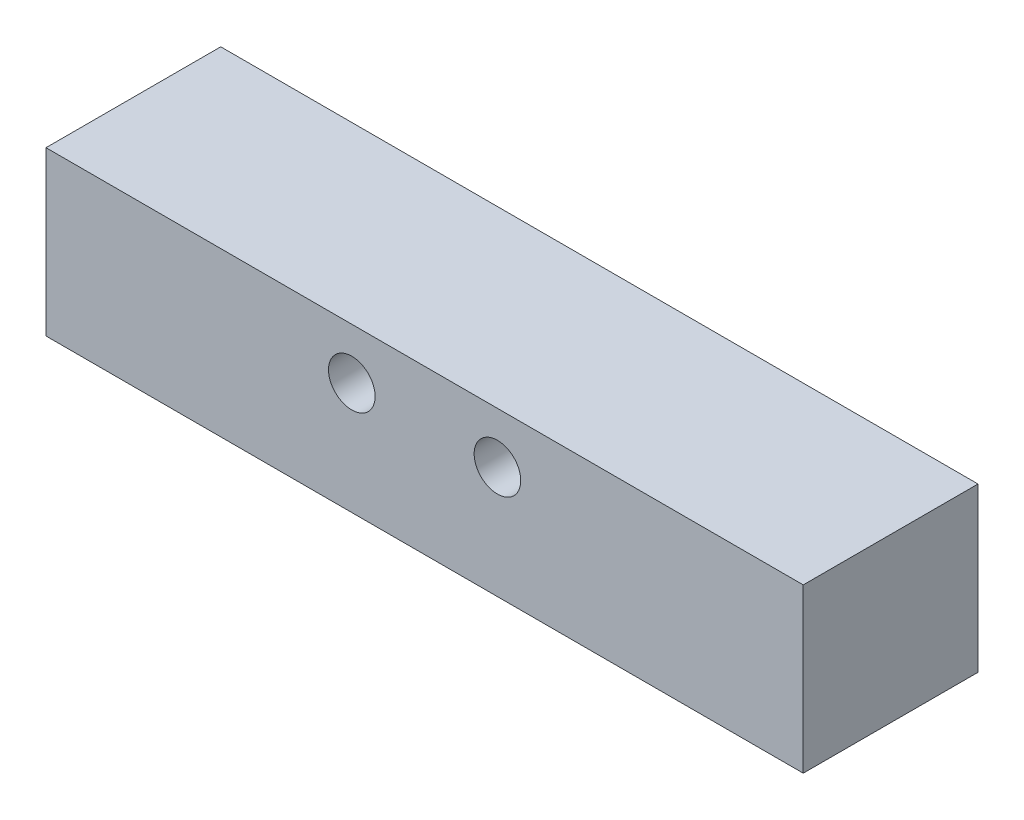
ISO-10303-21;
HEADER;
FILE_DESCRIPTION(('STEP AP214'),'2;1');
FILE_NAME('part.step','',(''),(''),'','','');
FILE_SCHEMA(('AUTOMOTIVE_DESIGN { 1 0 10303 214 1 1 1 1 }'));
ENDSEC;
DATA;
#1=APPLICATION_CONTEXT('core data for automotive mechanical design processes');
#2=APPLICATION_PROTOCOL_DEFINITION('international standard','automotive_design',2000,#1);
#3=PRODUCT_CONTEXT('',#1,'mechanical');
#4=PRODUCT('Part','Part','',(#3));
#5=PRODUCT_RELATED_PRODUCT_CATEGORY('part','',(#4));
#6=PRODUCT_DEFINITION_FORMATION('','',#4);
#7=PRODUCT_DEFINITION_CONTEXT('part definition',#1,'design');
#8=PRODUCT_DEFINITION('design','',#6,#7);
#9=PRODUCT_DEFINITION_SHAPE('','',#8);
#10=(LENGTH_UNIT() NAMED_UNIT(*) SI_UNIT(.MILLI.,.METRE.));
#11=(NAMED_UNIT(*) PLANE_ANGLE_UNIT() SI_UNIT($,.RADIAN.));
#12=(NAMED_UNIT(*) SI_UNIT($,.STERADIAN.) SOLID_ANGLE_UNIT());
#13=UNCERTAINTY_MEASURE_WITH_UNIT(LENGTH_MEASURE(1.E-05),#10,'distance_accuracy_value','');
#14=(GEOMETRIC_REPRESENTATION_CONTEXT(3) GLOBAL_UNCERTAINTY_ASSIGNED_CONTEXT((#13)) GLOBAL_UNIT_ASSIGNED_CONTEXT((#10,
#11,#12)) REPRESENTATION_CONTEXT('',''));
#15=CARTESIAN_POINT('',(0.,0.,0.));
#16=DIRECTION('',(0.,0.,1.));
#17=DIRECTION('',(1.,0.,0.));
#18=AXIS2_PLACEMENT_3D('',#15,#16,#17);
#19=CARTESIAN_POINT('',(-26.,-11.2,5.99999999999989));
#20=DIRECTION('',(0.,1.,0.));
#21=DIRECTION('',(0.,0.,-1.));
#22=AXIS2_PLACEMENT_3D('',#19,#20,#21);
#23=PLANE('',#22);
#24=CARTESIAN_POINT('',(-13.5,-11.2,0.));
#25=DIRECTION('',(0.,1.,0.));
#26=DIRECTION('',(0.,0.,-1.));
#27=AXIS2_PLACEMENT_3D('',#24,#25,#26);
#28=CIRCLE('',#27,4.5);
#29=CARTESIAN_POINT('',(-13.5,-11.2,-4.50000000000007));
#30=VERTEX_POINT('',#29);
#31=EDGE_CURVE('E101',#30,#30,#28,.F.);
#32=ORIENTED_EDGE('',*,*,#31,.F.);
#33=EDGE_LOOP('',(#32));
#34=FACE_BOUND('',#33,.T.);
#35=DIRECTION('',(0.,0.,1.));
#36=VECTOR('',#35,1.);
#37=CARTESIAN_POINT('',(26.,-11.2,6.00000000000007));
#38=LINE('',#37,#36);
#39=CARTESIAN_POINT('',(26.,-11.2,-5.99999999999993));
#40=VERTEX_POINT('',#39);
#41=CARTESIAN_POINT('',(26.,-11.2,6.00000000000007));
#42=VERTEX_POINT('',#41);
#43=EDGE_CURVE('E63',#40,#42,#38,.T.);
#44=ORIENTED_EDGE('',*,*,#43,.T.);
#45=DIRECTION('',(1.,0.,0.));
#46=VECTOR('',#45,1.);
#47=CARTESIAN_POINT('',(-26.,-11.2,5.99999999999989));
#48=LINE('',#47,#46);
#49=CARTESIAN_POINT('',(-26.,-11.2,5.99999999999989));
#50=VERTEX_POINT('',#49);
#51=EDGE_CURVE('E95',#50,#42,#48,.T.);
#52=ORIENTED_EDGE('',*,*,#51,.F.);
#53=DIRECTION('',(0.,0.,1.));
#54=VECTOR('',#53,1.);
#55=CARTESIAN_POINT('',(-26.,-11.2,5.99999999999989));
#56=LINE('',#55,#54);
#57=CARTESIAN_POINT('',(-26.,-11.2,-6.00000000000011));
#58=VERTEX_POINT('',#57);
#59=EDGE_CURVE('E36',#58,#50,#56,.T.);
#60=ORIENTED_EDGE('',*,*,#59,.F.);
#61=DIRECTION('',(1.,0.,0.));
#62=VECTOR('',#61,1.);
#63=CARTESIAN_POINT('',(-26.,-11.2,-6.00000000000011));
#64=LINE('',#63,#62);
#65=EDGE_CURVE('E75',#58,#40,#64,.T.);
#66=ORIENTED_EDGE('',*,*,#65,.T.);
#67=EDGE_LOOP('',(#44,#52,#60,#66));
#68=FACE_BOUND('',#67,.T.);
#69=CARTESIAN_POINT('',(0.,-11.2,0.));
#70=DIRECTION('',(0.,1.,0.));
#71=DIRECTION('',(0.,0.,-1.));
#72=AXIS2_PLACEMENT_3D('',#69,#70,#71);
#73=CIRCLE('',#72,4.5);
#74=CARTESIAN_POINT('',(0.,-11.2,-4.50000000000002));
#75=VERTEX_POINT('',#74);
#76=EDGE_CURVE('E74',#75,#75,#73,.F.);
#77=ORIENTED_EDGE('',*,*,#76,.F.);
#78=EDGE_LOOP('',(#77));
#79=FACE_BOUND('',#78,.T.);
#80=CARTESIAN_POINT('',(13.5,-11.2,0.));
#81=DIRECTION('',(0.,1.,0.));
#82=DIRECTION('',(0.,0.,-1.));
#83=AXIS2_PLACEMENT_3D('',#80,#81,#82);
#84=CIRCLE('',#83,4.5);
#85=CARTESIAN_POINT('',(13.5,-11.2,-4.49999999999998));
#86=VERTEX_POINT('',#85);
#87=EDGE_CURVE('E104',#86,#86,#84,.F.);
#88=ORIENTED_EDGE('',*,*,#87,.F.);
#89=EDGE_LOOP('',(#88));
#90=FACE_BOUND('',#89,.T.);
#91=ADVANCED_FACE('F16',(#34,#68,#79,#90),#23,.F.);
#92=CARTESIAN_POINT('',(-26.,0.,5.99999999999993));
#93=DIRECTION('',(0.,-1.,0.));
#94=DIRECTION('',(0.,0.,1.));
#95=AXIS2_PLACEMENT_3D('',#92,#93,#94);
#96=PLANE('',#95);
#97=DIRECTION('',(0.,0.,-1.));
#98=VECTOR('',#97,1.);
#99=CARTESIAN_POINT('',(26.,0.,6.00000000000011));
#100=LINE('',#99,#98);
#101=CARTESIAN_POINT('',(26.,0.,6.00000000000011));
#102=VERTEX_POINT('',#101);
#103=CARTESIAN_POINT('',(26.,0.,-5.99999999999989));
#104=VERTEX_POINT('',#103);
#105=EDGE_CURVE('E62',#102,#104,#100,.T.);
#106=ORIENTED_EDGE('',*,*,#105,.T.);
#107=DIRECTION('',(1.,0.,0.));
#108=VECTOR('',#107,1.);
#109=CARTESIAN_POINT('',(-26.,0.,-6.00000000000007));
#110=LINE('',#109,#108);
#111=CARTESIAN_POINT('',(-26.,0.,-6.00000000000007));
#112=VERTEX_POINT('',#111);
#113=EDGE_CURVE('E69',#112,#104,#110,.T.);
#114=ORIENTED_EDGE('',*,*,#113,.F.);
#115=DIRECTION('',(0.,0.,-1.));
#116=VECTOR('',#115,1.);
#117=CARTESIAN_POINT('',(-26.,0.,5.99999999999993));
#118=LINE('',#117,#116);
#119=CARTESIAN_POINT('',(-26.,0.,5.99999999999993));
#120=VERTEX_POINT('',#119);
#121=EDGE_CURVE('E89',#120,#112,#118,.T.);
#122=ORIENTED_EDGE('',*,*,#121,.F.);
#123=DIRECTION('',(1.,0.,0.));
#124=VECTOR('',#123,1.);
#125=CARTESIAN_POINT('',(-26.,0.,5.99999999999993));
#126=LINE('',#125,#124);
#127=EDGE_CURVE('E78',#120,#102,#126,.T.);
#128=ORIENTED_EDGE('',*,*,#127,.T.);
#129=EDGE_LOOP('',(#106,#114,#122,#128));
#130=FACE_BOUND('',#129,.T.);
#131=ADVANCED_FACE('F18',(#130),#96,.F.);
#132=CARTESIAN_POINT('',(-26.,0.,-6.00000000000007));
#133=DIRECTION('',(0.,0.,1.));
#134=DIRECTION('',(0.,1.,0.));
#135=AXIS2_PLACEMENT_3D('',#132,#133,#134);
#136=PLANE('',#135);
#137=CARTESIAN_POINT('',(-4.99999999999996,-3.49999999999996,-6.00000000000001));
#138=DIRECTION('',(0.,0.,1.));
#139=DIRECTION('',(-1.,0.,0.));
#140=AXIS2_PLACEMENT_3D('',#137,#138,#139);
#141=CIRCLE('',#140,1.6);
#142=CARTESIAN_POINT('',(-6.59999999999996,-3.49999999999996,-6.00000000000002));
#143=VERTEX_POINT('',#142);
#144=EDGE_CURVE('E152',#143,#143,#141,.T.);
#145=ORIENTED_EDGE('',*,*,#144,.T.);
#146=EDGE_LOOP('',(#145));
#147=FACE_BOUND('',#146,.T.);
#148=CARTESIAN_POINT('',(5.00000000000004,-3.49999999999996,-5.99999999999998));
#149=DIRECTION('',(0.,0.,1.));
#150=DIRECTION('',(-1.,0.,0.));
#151=AXIS2_PLACEMENT_3D('',#148,#149,#150);
#152=CIRCLE('',#151,1.6);
#153=CARTESIAN_POINT('',(3.40000000000004,-3.49999999999996,-5.99999999999998));
#154=VERTEX_POINT('',#153);
#155=EDGE_CURVE('E155',#154,#154,#152,.T.);
#156=ORIENTED_EDGE('',*,*,#155,.T.);
#157=EDGE_LOOP('',(#156));
#158=FACE_BOUND('',#157,.T.);
#159=DIRECTION('',(0.,-1.,0.));
#160=VECTOR('',#159,1.);
#161=CARTESIAN_POINT('',(26.,0.,-5.99999999999989));
#162=LINE('',#161,#160);
#163=EDGE_CURVE('E57',#104,#40,#162,.T.);
#164=ORIENTED_EDGE('',*,*,#163,.T.);
#165=ORIENTED_EDGE('',*,*,#65,.F.);
#166=DIRECTION('',(0.,-1.,0.));
#167=VECTOR('',#166,1.);
#168=CARTESIAN_POINT('',(-26.,0.,-6.00000000000007));
#169=LINE('',#168,#167);
#170=EDGE_CURVE('E71',#112,#58,#169,.T.);
#171=ORIENTED_EDGE('',*,*,#170,.F.);
#172=ORIENTED_EDGE('',*,*,#113,.T.);
#173=EDGE_LOOP('',(#164,#165,#171,#172));
#174=FACE_BOUND('',#173,.T.);
#175=ADVANCED_FACE('F70',(#147,#158,#174),#136,.F.);
#176=CARTESIAN_POINT('',(-26.,0.,5.99999999999993));
#177=DIRECTION('',(0.,0.,-1.));
#178=DIRECTION('',(0.,-1.,0.));
#179=AXIS2_PLACEMENT_3D('',#176,#177,#178);
#180=PLANE('',#179);
#181=CARTESIAN_POINT('',(-5.,-3.5,5.99999999999999));
#182=DIRECTION('',(0.,0.,1.));
#183=DIRECTION('',(-1.,0.,0.));
#184=AXIS2_PLACEMENT_3D('',#181,#182,#183);
#185=CIRCLE('',#184,1.6);
#186=CARTESIAN_POINT('',(-6.6,-3.5,5.99999999999998));
#187=VERTEX_POINT('',#186);
#188=EDGE_CURVE('E333',#187,#187,#185,.T.);
#189=ORIENTED_EDGE('',*,*,#188,.F.);
#190=EDGE_LOOP('',(#189));
#191=FACE_BOUND('',#190,.T.);
#192=CARTESIAN_POINT('',(5.,-3.5,6.00000000000002));
#193=DIRECTION('',(0.,0.,1.));
#194=DIRECTION('',(-1.,0.,0.));
#195=AXIS2_PLACEMENT_3D('',#192,#193,#194);
#196=CIRCLE('',#195,1.6);
#197=CARTESIAN_POINT('',(3.4,-3.5,6.00000000000002));
#198=VERTEX_POINT('',#197);
#199=EDGE_CURVE('E158',#198,#198,#196,.T.);
#200=ORIENTED_EDGE('',*,*,#199,.F.);
#201=EDGE_LOOP('',(#200));
#202=FACE_BOUND('',#201,.T.);
#203=DIRECTION('',(0.,1.,0.));
#204=VECTOR('',#203,1.);
#205=CARTESIAN_POINT('',(26.,0.,6.00000000000011));
#206=LINE('',#205,#204);
#207=EDGE_CURVE('E87',#42,#102,#206,.T.);
#208=ORIENTED_EDGE('',*,*,#207,.T.);
#209=ORIENTED_EDGE('',*,*,#127,.F.);
#210=DIRECTION('',(0.,1.,0.));
#211=VECTOR('',#210,1.);
#212=CARTESIAN_POINT('',(-26.,0.,5.99999999999993));
#213=LINE('',#212,#211);
#214=EDGE_CURVE('E31',#50,#120,#213,.T.);
#215=ORIENTED_EDGE('',*,*,#214,.F.);
#216=ORIENTED_EDGE('',*,*,#51,.T.);
#217=EDGE_LOOP('',(#208,#209,#215,#216));
#218=FACE_BOUND('',#217,.T.);
#219=ADVANCED_FACE('F140',(#191,#202,#218),#180,.F.);
#220=CARTESIAN_POINT('',(-26.,0.,5.99999999999993));
#221=DIRECTION('',(-1.,0.,0.));
#222=DIRECTION('',(0.,-1.,0.));
#223=AXIS2_PLACEMENT_3D('',#220,#221,#222);
#224=PLANE('',#223);
#225=ORIENTED_EDGE('',*,*,#121,.T.);
#226=ORIENTED_EDGE('',*,*,#170,.T.);
#227=ORIENTED_EDGE('',*,*,#59,.T.);
#228=ORIENTED_EDGE('',*,*,#214,.T.);
#229=EDGE_LOOP('',(#225,#226,#227,#228));
#230=FACE_BOUND('',#229,.T.);
#231=ADVANCED_FACE('F147',(#230),#224,.T.);
#232=CARTESIAN_POINT('',(26.,0.,6.00000000000011));
#233=DIRECTION('',(-1.,0.,0.));
#234=DIRECTION('',(0.,-1.,0.));
#235=AXIS2_PLACEMENT_3D('',#232,#233,#234);
#236=PLANE('',#235);
#237=ORIENTED_EDGE('',*,*,#105,.F.);
#238=ORIENTED_EDGE('',*,*,#207,.F.);
#239=ORIENTED_EDGE('',*,*,#43,.F.);
#240=ORIENTED_EDGE('',*,*,#163,.F.);
#241=EDGE_LOOP('',(#237,#238,#239,#240));
#242=FACE_BOUND('',#241,.T.);
#243=ADVANCED_FACE('F59',(#242),#236,.F.);
#244=CARTESIAN_POINT('',(0.,-11.4,0.));
#245=DIRECTION('',(0.,-1.,0.));
#246=DIRECTION('',(0.,0.,1.));
#247=AXIS2_PLACEMENT_3D('',#244,#245,#246);
#248=PLANE('',#247);
#249=CARTESIAN_POINT('',(0.,-11.4,0.));
#250=DIRECTION('',(0.,-1.,0.));
#251=DIRECTION('',(0.,0.,1.));
#252=AXIS2_PLACEMENT_3D('',#249,#250,#251);
#253=CIRCLE('',#252,2.5);
#254=CARTESIAN_POINT('',(0.,-11.4,2.49999999999998));
#255=VERTEX_POINT('',#254);
#256=EDGE_CURVE('E169',#255,#255,#253,.T.);
#257=ORIENTED_EDGE('',*,*,#256,.F.);
#258=EDGE_LOOP('',(#257));
#259=FACE_BOUND('',#258,.T.);
#260=CARTESIAN_POINT('',(0.,-11.4,0.));
#261=DIRECTION('',(0.,-1.,0.));
#262=DIRECTION('',(0.,0.,1.));
#263=AXIS2_PLACEMENT_3D('',#260,#261,#262);
#264=CIRCLE('',#263,4.3);
#265=CARTESIAN_POINT('',(0.,-11.4,4.29999999999998));
#266=VERTEX_POINT('',#265);
#267=EDGE_CURVE('E24',#266,#266,#264,.T.);
#268=ORIENTED_EDGE('',*,*,#267,.T.);
#269=EDGE_LOOP('',(#268));
#270=FACE_BOUND('',#269,.T.);
#271=ADVANCED_FACE('F112',(#259,#270),#248,.T.);
#272=CARTESIAN_POINT('',(-13.5,-11.4,0.));
#273=DIRECTION('',(0.,-1.,0.));
#274=DIRECTION('',(0.,0.,1.));
#275=AXIS2_PLACEMENT_3D('',#272,#273,#274);
#276=PLANE('',#275);
#277=CARTESIAN_POINT('',(-13.5,-11.4,0.));
#278=DIRECTION('',(0.,-1.,0.));
#279=DIRECTION('',(0.,0.,1.));
#280=AXIS2_PLACEMENT_3D('',#277,#278,#279);
#281=CIRCLE('',#280,2.5);
#282=CARTESIAN_POINT('',(-13.5,-11.4,2.49999999999994));
#283=VERTEX_POINT('',#282);
#284=EDGE_CURVE('E157',#283,#283,#281,.T.);
#285=ORIENTED_EDGE('',*,*,#284,.F.);
#286=EDGE_LOOP('',(#285));
#287=FACE_BOUND('',#286,.T.);
#288=CARTESIAN_POINT('',(-13.5,-11.4,0.));
#289=DIRECTION('',(0.,-1.,0.));
#290=DIRECTION('',(0.,0.,1.));
#291=AXIS2_PLACEMENT_3D('',#288,#289,#290);
#292=CIRCLE('',#291,4.3);
#293=CARTESIAN_POINT('',(-13.5,-11.4,4.29999999999994));
#294=VERTEX_POINT('',#293);
#295=EDGE_CURVE('E10',#294,#294,#292,.T.);
#296=ORIENTED_EDGE('',*,*,#295,.T.);
#297=EDGE_LOOP('',(#296));
#298=FACE_BOUND('',#297,.T.);
#299=ADVANCED_FACE('F180',(#287,#298),#276,.T.);
#300=CARTESIAN_POINT('',(13.5,-11.4,0.));
#301=DIRECTION('',(0.,-1.,0.));
#302=DIRECTION('',(0.,0.,1.));
#303=AXIS2_PLACEMENT_3D('',#300,#301,#302);
#304=PLANE('',#303);
#305=CARTESIAN_POINT('',(13.5,-11.4,0.));
#306=DIRECTION('',(0.,-1.,0.));
#307=DIRECTION('',(0.,0.,1.));
#308=AXIS2_PLACEMENT_3D('',#305,#306,#307);
#309=CIRCLE('',#308,2.5);
#310=CARTESIAN_POINT('',(13.5,-11.4,2.50000000000003));
#311=VERTEX_POINT('',#310);
#312=EDGE_CURVE('E82',#311,#311,#309,.T.);
#313=ORIENTED_EDGE('',*,*,#312,.F.);
#314=EDGE_LOOP('',(#313));
#315=FACE_BOUND('',#314,.T.);
#316=CARTESIAN_POINT('',(13.5,-11.4,0.));
#317=DIRECTION('',(0.,-1.,0.));
#318=DIRECTION('',(0.,0.,1.));
#319=AXIS2_PLACEMENT_3D('',#316,#317,#318);
#320=CIRCLE('',#319,4.3);
#321=CARTESIAN_POINT('',(13.5,-11.4,4.30000000000003));
#322=VERTEX_POINT('',#321);
#323=EDGE_CURVE('E107',#322,#322,#320,.T.);
#324=ORIENTED_EDGE('',*,*,#323,.T.);
#325=EDGE_LOOP('',(#324));
#326=FACE_BOUND('',#325,.T.);
#327=ADVANCED_FACE('F128',(#315,#326),#304,.T.);
#328=CARTESIAN_POINT('',(13.5,-11.4,0.));
#329=DIRECTION('',(0.,1.,0.));
#330=DIRECTION('',(-1.,0.,0.));
#331=AXIS2_PLACEMENT_3D('',#328,#329,#330);
#332=CONICAL_SURFACE('',#331,4.3,0.785398163397448);
#333=ORIENTED_EDGE('',*,*,#87,.T.);
#334=EDGE_LOOP('',(#333));
#335=FACE_BOUND('',#334,.T.);
#336=ORIENTED_EDGE('',*,*,#323,.F.);
#337=EDGE_LOOP('',(#336));
#338=FACE_BOUND('',#337,.T.);
#339=ADVANCED_FACE('F117',(#335,#338),#332,.T.);
#340=CARTESIAN_POINT('',(0.,-11.4,0.));
#341=DIRECTION('',(0.,1.,0.));
#342=DIRECTION('',(-1.,0.,0.));
#343=AXIS2_PLACEMENT_3D('',#340,#341,#342);
#344=CONICAL_SURFACE('',#343,4.3,0.785398163397453);
#345=ORIENTED_EDGE('',*,*,#76,.T.);
#346=EDGE_LOOP('',(#345));
#347=FACE_BOUND('',#346,.T.);
#348=ORIENTED_EDGE('',*,*,#267,.F.);
#349=EDGE_LOOP('',(#348));
#350=FACE_BOUND('',#349,.T.);
#351=ADVANCED_FACE('F114',(#347,#350),#344,.T.);
#352=CARTESIAN_POINT('',(-13.5,-11.4,0.));
#353=DIRECTION('',(0.,1.,0.));
#354=DIRECTION('',(-1.,0.,0.));
#355=AXIS2_PLACEMENT_3D('',#352,#353,#354);
#356=CONICAL_SURFACE('',#355,4.3,0.785398163397448);
#357=ORIENTED_EDGE('',*,*,#31,.T.);
#358=EDGE_LOOP('',(#357));
#359=FACE_BOUND('',#358,.T.);
#360=ORIENTED_EDGE('',*,*,#295,.F.);
#361=EDGE_LOOP('',(#360));
#362=FACE_BOUND('',#361,.T.);
#363=ADVANCED_FACE('F116',(#359,#362),#356,.T.);
#364=CARTESIAN_POINT('',(13.5,-6.39999999999998,0.));
#365=DIRECTION('',(0.,-1.,0.));
#366=DIRECTION('',(0.,0.,1.));
#367=AXIS2_PLACEMENT_3D('',#364,#365,#366);
#368=CYLINDRICAL_SURFACE('',#367,2.5);
#369=CARTESIAN_POINT('',(13.5,-6.39999999999998,0.));
#370=DIRECTION('',(0.,-1.,0.));
#371=DIRECTION('',(0.,0.,1.));
#372=AXIS2_PLACEMENT_3D('',#369,#370,#371);
#373=CIRCLE('',#372,2.5);
#374=CARTESIAN_POINT('',(13.5,-6.39999999999999,2.50000000000004));
#375=VERTEX_POINT('',#374);
#376=EDGE_CURVE('E79',#375,#375,#373,.T.);
#377=ORIENTED_EDGE('',*,*,#376,.F.);
#378=EDGE_LOOP('',(#377));
#379=FACE_BOUND('',#378,.T.);
#380=ORIENTED_EDGE('',*,*,#312,.T.);
#381=EDGE_LOOP('',(#380));
#382=FACE_BOUND('',#381,.T.);
#383=ADVANCED_FACE('F125',(#379,#382),#368,.F.);
#384=CARTESIAN_POINT('',(13.5,-6.39999999999998,0.));
#385=DIRECTION('',(0.,-1.,0.));
#386=DIRECTION('',(0.,0.,1.));
#387=AXIS2_PLACEMENT_3D('',#384,#385,#386);
#388=PLANE('',#387);
#389=ORIENTED_EDGE('',*,*,#376,.T.);
#390=EDGE_LOOP('',(#389));
#391=FACE_BOUND('',#390,.T.);
#392=ADVANCED_FACE('F256',(#391),#388,.T.);
#393=CARTESIAN_POINT('',(0.,-6.39999999999998,0.));
#394=DIRECTION('',(0.,-1.,0.));
#395=DIRECTION('',(0.,0.,1.));
#396=AXIS2_PLACEMENT_3D('',#393,#394,#395);
#397=CYLINDRICAL_SURFACE('',#396,2.5);
#398=CARTESIAN_POINT('',(0.,-6.39999999999998,0.));
#399=DIRECTION('',(0.,-1.,0.));
#400=DIRECTION('',(0.,0.,1.));
#401=AXIS2_PLACEMENT_3D('',#398,#399,#400);
#402=CIRCLE('',#401,2.5);
#403=CARTESIAN_POINT('',(0.,-6.39999999999999,2.5));
#404=VERTEX_POINT('',#403);
#405=EDGE_CURVE('E172',#404,#404,#402,.T.);
#406=ORIENTED_EDGE('',*,*,#405,.F.);
#407=EDGE_LOOP('',(#406));
#408=FACE_BOUND('',#407,.T.);
#409=ORIENTED_EDGE('',*,*,#256,.T.);
#410=EDGE_LOOP('',(#409));
#411=FACE_BOUND('',#410,.T.);
#412=ADVANCED_FACE('F266',(#408,#411),#397,.F.);
#413=CARTESIAN_POINT('',(0.,-6.39999999999998,0.));
#414=DIRECTION('',(0.,-1.,0.));
#415=DIRECTION('',(0.,0.,1.));
#416=AXIS2_PLACEMENT_3D('',#413,#414,#415);
#417=PLANE('',#416);
#418=ORIENTED_EDGE('',*,*,#405,.T.);
#419=EDGE_LOOP('',(#418));
#420=FACE_BOUND('',#419,.T.);
#421=ADVANCED_FACE('F276',(#420),#417,.T.);
#422=CARTESIAN_POINT('',(-13.5,-6.39999999999998,0.));
#423=DIRECTION('',(0.,-1.,0.));
#424=DIRECTION('',(0.,0.,1.));
#425=AXIS2_PLACEMENT_3D('',#422,#423,#424);
#426=CYLINDRICAL_SURFACE('',#425,2.5);
#427=CARTESIAN_POINT('',(-13.5,-6.39999999999998,0.));
#428=DIRECTION('',(0.,-1.,0.));
#429=DIRECTION('',(0.,0.,1.));
#430=AXIS2_PLACEMENT_3D('',#427,#428,#429);
#431=CIRCLE('',#430,2.5);
#432=CARTESIAN_POINT('',(-13.5,-6.39999999999999,2.49999999999995));
#433=VERTEX_POINT('',#432);
#434=EDGE_CURVE('E161',#433,#433,#431,.T.);
#435=ORIENTED_EDGE('',*,*,#434,.F.);
#436=EDGE_LOOP('',(#435));
#437=FACE_BOUND('',#436,.T.);
#438=ORIENTED_EDGE('',*,*,#284,.T.);
#439=EDGE_LOOP('',(#438));
#440=FACE_BOUND('',#439,.T.);
#441=ADVANCED_FACE('F286',(#437,#440),#426,.F.);
#442=CARTESIAN_POINT('',(-13.5,-6.39999999999998,0.));
#443=DIRECTION('',(0.,-1.,0.));
#444=DIRECTION('',(0.,0.,1.));
#445=AXIS2_PLACEMENT_3D('',#442,#443,#444);
#446=PLANE('',#445);
#447=ORIENTED_EDGE('',*,*,#434,.T.);
#448=EDGE_LOOP('',(#447));
#449=FACE_BOUND('',#448,.T.);
#450=ADVANCED_FACE('F296',(#449),#446,.T.);
#451=CARTESIAN_POINT('',(5.00000000000004,-3.49999999999996,-5.99999999999998));
#452=DIRECTION('',(0.,0.,1.));
#453=DIRECTION('',(-1.,0.,0.));
#454=AXIS2_PLACEMENT_3D('',#451,#452,#453);
#455=CYLINDRICAL_SURFACE('',#454,1.6);
#456=ORIENTED_EDGE('',*,*,#155,.F.);
#457=EDGE_LOOP('',(#456));
#458=FACE_BOUND('',#457,.T.);
#459=ORIENTED_EDGE('',*,*,#199,.T.);
#460=EDGE_LOOP('',(#459));
#461=FACE_BOUND('',#460,.T.);
#462=ADVANCED_FACE('F306',(#458,#461),#455,.F.);
#463=CARTESIAN_POINT('',(-4.99999999999996,-3.49999999999996,-6.00000000000001));
#464=DIRECTION('',(0.,0.,1.));
#465=DIRECTION('',(-1.,0.,0.));
#466=AXIS2_PLACEMENT_3D('',#463,#464,#465);
#467=CYLINDRICAL_SURFACE('',#466,1.6);
#468=ORIENTED_EDGE('',*,*,#144,.F.);
#469=EDGE_LOOP('',(#468));
#470=FACE_BOUND('',#469,.T.);
#471=ORIENTED_EDGE('',*,*,#188,.T.);
#472=EDGE_LOOP('',(#471));
#473=FACE_BOUND('',#472,.T.);
#474=ADVANCED_FACE('F316',(#470,#473),#467,.F.);
#475=CLOSED_SHELL('',(#91,#131,#175,#219,#231,#243,#271,#299,#327,#339,#351,#363,#383,#392,#412,
#421,#441,#450,#462,#474));
#476=MANIFOLD_SOLID_BREP('B1',#475);
#477=ADVANCED_BREP_SHAPE_REPRESENTATION('',(#18,#476),#14);
#478=SHAPE_DEFINITION_REPRESENTATION(#9,#477);
ENDSEC;
END-ISO-10303-21;
